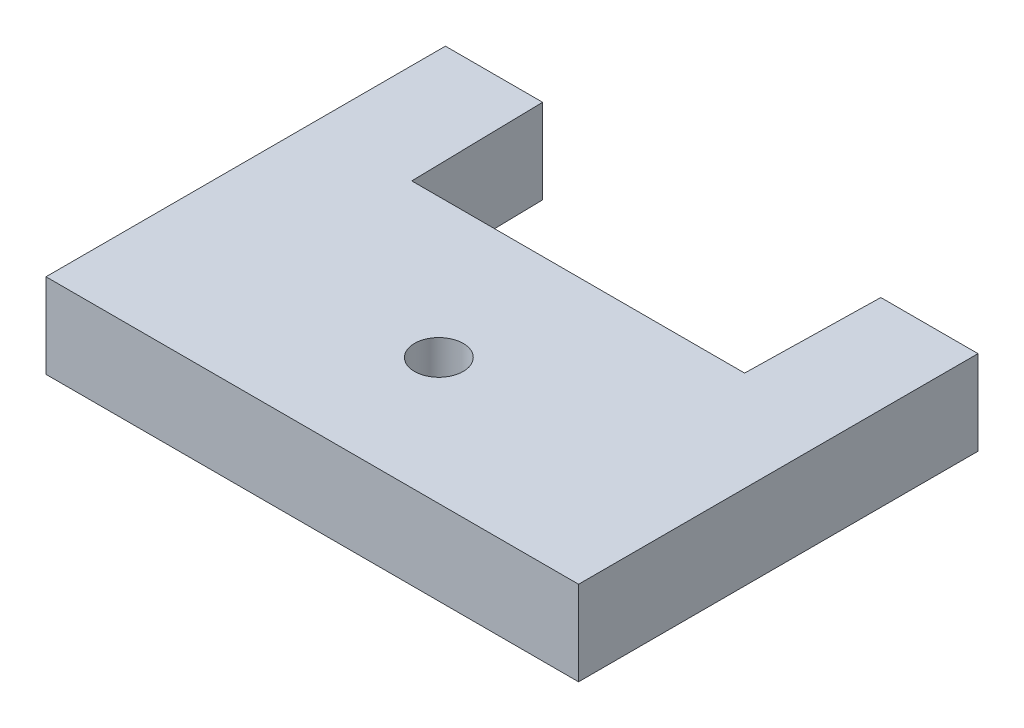
ISO-10303-21;
HEADER;
FILE_DESCRIPTION(('STEP AP214'),'2;1');
FILE_NAME('part.step','',(''),(''),'','','');
FILE_SCHEMA(('AUTOMOTIVE_DESIGN { 1 0 10303 214 1 1 1 1 }'));
ENDSEC;
DATA;
#1=APPLICATION_CONTEXT('core data for automotive mechanical design processes');
#2=APPLICATION_PROTOCOL_DEFINITION('international standard','automotive_design',2000,#1);
#3=PRODUCT_CONTEXT('',#1,'mechanical');
#4=PRODUCT('Part','Part','',(#3));
#5=PRODUCT_RELATED_PRODUCT_CATEGORY('part','',(#4));
#6=PRODUCT_DEFINITION_FORMATION('','',#4);
#7=PRODUCT_DEFINITION_CONTEXT('part definition',#1,'design');
#8=PRODUCT_DEFINITION('design','',#6,#7);
#9=PRODUCT_DEFINITION_SHAPE('','',#8);
#10=(LENGTH_UNIT() NAMED_UNIT(*) SI_UNIT(.MILLI.,.METRE.));
#11=(NAMED_UNIT(*) PLANE_ANGLE_UNIT() SI_UNIT($,.RADIAN.));
#12=(NAMED_UNIT(*) SI_UNIT($,.STERADIAN.) SOLID_ANGLE_UNIT());
#13=UNCERTAINTY_MEASURE_WITH_UNIT(LENGTH_MEASURE(1.E-05),#10,'distance_accuracy_value','');
#14=(GEOMETRIC_REPRESENTATION_CONTEXT(3) GLOBAL_UNCERTAINTY_ASSIGNED_CONTEXT((#13)) GLOBAL_UNIT_ASSIGNED_CONTEXT((#10,
#11,#12)) REPRESENTATION_CONTEXT('',''));
#15=CARTESIAN_POINT('',(0.,0.,0.));
#16=DIRECTION('',(0.,0.,1.));
#17=DIRECTION('',(1.,0.,0.));
#18=AXIS2_PLACEMENT_3D('',#15,#16,#17);
#19=CARTESIAN_POINT('',(-20.,6.35,-15.));
#20=DIRECTION('',(0.,0.,1.));
#21=DIRECTION('',(1.,0.,0.));
#22=AXIS2_PLACEMENT_3D('',#19,#20,#21);
#23=PLANE('',#22);
#24=DIRECTION('',(-1.,0.,0.));
#25=VECTOR('',#24,1.);
#26=CARTESIAN_POINT('',(-20.,0.,-15.));
#27=LINE('',#26,#25);
#28=CARTESIAN_POINT('',(20.,0.,-15.));
#29=VERTEX_POINT('',#28);
#30=CARTESIAN_POINT('',(12.7,0.,-15.));
#31=VERTEX_POINT('',#30);
#32=EDGE_CURVE('E131',#29,#31,#27,.T.);
#33=ORIENTED_EDGE('',*,*,#32,.T.);
#34=DIRECTION('',(0.,1.,0.));
#35=VECTOR('',#34,1.);
#36=CARTESIAN_POINT('',(12.7,0.,-15.));
#37=LINE('',#36,#35);
#38=CARTESIAN_POINT('',(12.7,6.35,-15.));
#39=VERTEX_POINT('',#38);
#40=EDGE_CURVE('E136',#31,#39,#37,.T.);
#41=ORIENTED_EDGE('',*,*,#40,.T.);
#42=DIRECTION('',(-1.,0.,0.));
#43=VECTOR('',#42,1.);
#44=CARTESIAN_POINT('',(-20.,6.35,-15.));
#45=LINE('',#44,#43);
#46=CARTESIAN_POINT('',(20.,6.35,-15.));
#47=VERTEX_POINT('',#46);
#48=EDGE_CURVE('E85',#47,#39,#45,.T.);
#49=ORIENTED_EDGE('',*,*,#48,.F.);
#50=DIRECTION('',(0.,-1.,0.));
#51=VECTOR('',#50,1.);
#52=CARTESIAN_POINT('',(20.,6.35,-15.));
#53=LINE('',#52,#51);
#54=EDGE_CURVE('E11',#47,#29,#53,.T.);
#55=ORIENTED_EDGE('',*,*,#54,.T.);
#56=EDGE_LOOP('',(#33,#41,#49,#55));
#57=FACE_BOUND('',#56,.T.);
#58=ADVANCED_FACE('F33',(#57),#23,.F.);
#59=CARTESIAN_POINT('',(20.,6.35,15.));
#60=DIRECTION('',(-1.,0.,0.));
#61=DIRECTION('',(0.,0.,1.));
#62=AXIS2_PLACEMENT_3D('',#59,#60,#61);
#63=PLANE('',#62);
#64=DIRECTION('',(0.,0.,-1.));
#65=VECTOR('',#64,1.);
#66=CARTESIAN_POINT('',(20.,0.,15.));
#67=LINE('',#66,#65);
#68=CARTESIAN_POINT('',(20.,0.,15.));
#69=VERTEX_POINT('',#68);
#70=EDGE_CURVE('E132',#69,#29,#67,.T.);
#71=ORIENTED_EDGE('',*,*,#70,.T.);
#72=ORIENTED_EDGE('',*,*,#54,.F.);
#73=DIRECTION('',(0.,0.,-1.));
#74=VECTOR('',#73,1.);
#75=CARTESIAN_POINT('',(20.,6.35,15.));
#76=LINE('',#75,#74);
#77=CARTESIAN_POINT('',(20.,6.35,15.));
#78=VERTEX_POINT('',#77);
#79=EDGE_CURVE('E142',#78,#47,#76,.T.);
#80=ORIENTED_EDGE('',*,*,#79,.F.);
#81=DIRECTION('',(0.,-1.,0.));
#82=VECTOR('',#81,1.);
#83=CARTESIAN_POINT('',(20.,6.35,15.));
#84=LINE('',#83,#82);
#85=EDGE_CURVE('E143',#78,#69,#84,.T.);
#86=ORIENTED_EDGE('',*,*,#85,.T.);
#87=EDGE_LOOP('',(#71,#72,#80,#86));
#88=FACE_BOUND('',#87,.T.);
#89=ADVANCED_FACE('F35',(#88),#63,.F.);
#90=CARTESIAN_POINT('',(-12.7,6.35,-15.));
#91=VERTEX_POINT('',#90);
#92=CARTESIAN_POINT('',(-20.,6.35,-15.));
#93=VERTEX_POINT('',#92);
#94=EDGE_CURVE('E124',#91,#93,#45,.T.);
#95=ORIENTED_EDGE('',*,*,#94,.F.);
#96=DIRECTION('',(0.,1.,0.));
#97=VECTOR('',#96,1.);
#98=CARTESIAN_POINT('',(-12.7,0.,-15.));
#99=LINE('',#98,#97);
#100=CARTESIAN_POINT('',(-12.7,0.,-15.));
#101=VERTEX_POINT('',#100);
#102=EDGE_CURVE('E111',#101,#91,#99,.T.);
#103=ORIENTED_EDGE('',*,*,#102,.F.);
#104=CARTESIAN_POINT('',(-20.,0.,-15.));
#105=VERTEX_POINT('',#104);
#106=EDGE_CURVE('E122',#101,#105,#27,.T.);
#107=ORIENTED_EDGE('',*,*,#106,.T.);
#108=DIRECTION('',(0.,-1.,0.));
#109=VECTOR('',#108,1.);
#110=CARTESIAN_POINT('',(-20.,6.35,-15.));
#111=LINE('',#110,#109);
#112=EDGE_CURVE('E41',#93,#105,#111,.T.);
#113=ORIENTED_EDGE('',*,*,#112,.F.);
#114=EDGE_LOOP('',(#95,#103,#107,#113));
#115=FACE_BOUND('',#114,.T.);
#116=ADVANCED_FACE('F120',(#115),#23,.F.);
#117=CARTESIAN_POINT('',(-20.,6.35,15.));
#118=DIRECTION('',(1.,0.,0.));
#119=DIRECTION('',(0.,0.,-1.));
#120=AXIS2_PLACEMENT_3D('',#117,#118,#119);
#121=PLANE('',#120);
#122=DIRECTION('',(0.,0.,1.));
#123=VECTOR('',#122,1.);
#124=CARTESIAN_POINT('',(-20.,0.,15.));
#125=LINE('',#124,#123);
#126=CARTESIAN_POINT('',(-20.,0.,15.));
#127=VERTEX_POINT('',#126);
#128=EDGE_CURVE('E130',#105,#127,#125,.T.);
#129=ORIENTED_EDGE('',*,*,#128,.T.);
#130=DIRECTION('',(0.,-1.,0.));
#131=VECTOR('',#130,1.);
#132=CARTESIAN_POINT('',(-20.,6.35,15.));
#133=LINE('',#132,#131);
#134=CARTESIAN_POINT('',(-20.,6.35,15.));
#135=VERTEX_POINT('',#134);
#136=EDGE_CURVE('E145',#135,#127,#133,.T.);
#137=ORIENTED_EDGE('',*,*,#136,.F.);
#138=DIRECTION('',(0.,0.,1.));
#139=VECTOR('',#138,1.);
#140=CARTESIAN_POINT('',(-20.,6.35,15.));
#141=LINE('',#140,#139);
#142=EDGE_CURVE('E150',#93,#135,#141,.T.);
#143=ORIENTED_EDGE('',*,*,#142,.F.);
#144=ORIENTED_EDGE('',*,*,#112,.T.);
#145=EDGE_LOOP('',(#129,#137,#143,#144));
#146=FACE_BOUND('',#145,.T.);
#147=ADVANCED_FACE('F148',(#146),#121,.F.);
#148=CARTESIAN_POINT('',(-20.,6.35,15.));
#149=DIRECTION('',(0.,0.,-1.));
#150=DIRECTION('',(-1.,0.,0.));
#151=AXIS2_PLACEMENT_3D('',#148,#149,#150);
#152=PLANE('',#151);
#153=DIRECTION('',(1.,0.,0.));
#154=VECTOR('',#153,1.);
#155=CARTESIAN_POINT('',(-20.,0.,15.));
#156=LINE('',#155,#154);
#157=EDGE_CURVE('E78',#127,#69,#156,.T.);
#158=ORIENTED_EDGE('',*,*,#157,.T.);
#159=ORIENTED_EDGE('',*,*,#85,.F.);
#160=DIRECTION('',(1.,0.,0.));
#161=VECTOR('',#160,1.);
#162=CARTESIAN_POINT('',(-20.,6.35,15.));
#163=LINE('',#162,#161);
#164=EDGE_CURVE('E57',#135,#78,#163,.T.);
#165=ORIENTED_EDGE('',*,*,#164,.F.);
#166=ORIENTED_EDGE('',*,*,#136,.T.);
#167=EDGE_LOOP('',(#158,#159,#165,#166));
#168=FACE_BOUND('',#167,.T.);
#169=ADVANCED_FACE('F178',(#168),#152,.F.);
#170=CARTESIAN_POINT('',(0.,6.35,0.));
#171=DIRECTION('',(0.,-1.,0.));
#172=DIRECTION('',(0.,0.,-1.));
#173=AXIS2_PLACEMENT_3D('',#170,#171,#172);
#174=PLANE('',#173);
#175=CARTESIAN_POINT('',(0.,6.35,5.4948));
#176=DIRECTION('',(0.,1.,0.));
#177=DIRECTION('',(0.,0.,1.));
#178=AXIS2_PLACEMENT_3D('',#175,#176,#177);
#179=CIRCLE('',#178,1.8288);
#180=CARTESIAN_POINT('',(0.,6.35,7.3236));
#181=VERTEX_POINT('',#180);
#182=EDGE_CURVE('E170',#181,#181,#179,.T.);
#183=ORIENTED_EDGE('',*,*,#182,.F.);
#184=EDGE_LOOP('',(#183));
#185=FACE_BOUND('',#184,.T.);
#186=ORIENTED_EDGE('',*,*,#48,.T.);
#187=DIRECTION('',(0.0199362164284595,0.,-0.99980125388725));
#188=VECTOR('',#187,1.);
#189=CARTESIAN_POINT('',(12.5,6.35,-4.97));
#190=LINE('',#189,#188);
#191=CARTESIAN_POINT('',(12.5,6.35,-4.97));
#192=VERTEX_POINT('',#191);
#193=EDGE_CURVE('E116',#192,#39,#190,.T.);
#194=ORIENTED_EDGE('',*,*,#193,.F.);
#195=DIRECTION('',(1.,0.,0.));
#196=VECTOR('',#195,1.);
#197=CARTESIAN_POINT('',(-12.5,6.35,-4.97));
#198=LINE('',#197,#196);
#199=CARTESIAN_POINT('',(-12.5,6.35,-4.97));
#200=VERTEX_POINT('',#199);
#201=EDGE_CURVE('E160',#200,#192,#198,.T.);
#202=ORIENTED_EDGE('',*,*,#201,.F.);
#203=DIRECTION('',(0.0199362164284595,0.,0.99980125388725));
#204=VECTOR('',#203,1.);
#205=CARTESIAN_POINT('',(-12.7,6.35,-15.));
#206=LINE('',#205,#204);
#207=EDGE_CURVE('E163',#91,#200,#206,.T.);
#208=ORIENTED_EDGE('',*,*,#207,.F.);
#209=ORIENTED_EDGE('',*,*,#94,.T.);
#210=ORIENTED_EDGE('',*,*,#142,.T.);
#211=ORIENTED_EDGE('',*,*,#164,.T.);
#212=ORIENTED_EDGE('',*,*,#79,.T.);
#213=EDGE_LOOP('',(#186,#194,#202,#208,#209,#210,#211,#212));
#214=FACE_BOUND('',#213,.T.);
#215=ADVANCED_FACE('F176',(#185,#214),#174,.F.);
#216=CARTESIAN_POINT('',(0.,0.,0.));
#217=DIRECTION('',(0.,-1.,0.));
#218=DIRECTION('',(0.,0.,-1.));
#219=AXIS2_PLACEMENT_3D('',#216,#217,#218);
#220=PLANE('',#219);
#221=CARTESIAN_POINT('',(0.,0.,5.4948));
#222=DIRECTION('',(0.,1.,0.));
#223=DIRECTION('',(0.,0.,1.));
#224=AXIS2_PLACEMENT_3D('',#221,#222,#223);
#225=CIRCLE('',#224,1.8288);
#226=CARTESIAN_POINT('',(0.,0.,7.3236));
#227=VERTEX_POINT('',#226);
#228=EDGE_CURVE('E165',#227,#227,#225,.T.);
#229=ORIENTED_EDGE('',*,*,#228,.T.);
#230=EDGE_LOOP('',(#229));
#231=FACE_BOUND('',#230,.T.);
#232=DIRECTION('',(0.0199362164284595,0.,-0.99980125388725));
#233=VECTOR('',#232,1.);
#234=CARTESIAN_POINT('',(12.5,0.,-4.97));
#235=LINE('',#234,#233);
#236=CARTESIAN_POINT('',(12.5,0.,-4.97));
#237=VERTEX_POINT('',#236);
#238=EDGE_CURVE('E125',#237,#31,#235,.T.);
#239=ORIENTED_EDGE('',*,*,#238,.T.);
#240=ORIENTED_EDGE('',*,*,#32,.F.);
#241=ORIENTED_EDGE('',*,*,#70,.F.);
#242=ORIENTED_EDGE('',*,*,#157,.F.);
#243=ORIENTED_EDGE('',*,*,#128,.F.);
#244=ORIENTED_EDGE('',*,*,#106,.F.);
#245=DIRECTION('',(0.0199362164284595,0.,0.99980125388725));
#246=VECTOR('',#245,1.);
#247=CARTESIAN_POINT('',(-12.7,0.,-15.));
#248=LINE('',#247,#246);
#249=CARTESIAN_POINT('',(-12.5,0.,-4.97));
#250=VERTEX_POINT('',#249);
#251=EDGE_CURVE('E107',#101,#250,#248,.T.);
#252=ORIENTED_EDGE('',*,*,#251,.T.);
#253=DIRECTION('',(1.,0.,0.));
#254=VECTOR('',#253,1.);
#255=CARTESIAN_POINT('',(-12.5,0.,-4.97));
#256=LINE('',#255,#254);
#257=EDGE_CURVE('E48',#250,#237,#256,.T.);
#258=ORIENTED_EDGE('',*,*,#257,.T.);
#259=EDGE_LOOP('',(#239,#240,#241,#242,#243,#244,#252,#258));
#260=FACE_BOUND('',#259,.T.);
#261=ADVANCED_FACE('F129',(#231,#260),#220,.T.);
#262=CARTESIAN_POINT('',(12.5,0.,-4.97));
#263=DIRECTION('',(0.99980125388725,0.,0.0199362164284595));
#264=DIRECTION('',(0.0199362164284595,0.,-0.99980125388725));
#265=AXIS2_PLACEMENT_3D('',#262,#263,#264);
#266=PLANE('',#265);
#267=ORIENTED_EDGE('',*,*,#193,.T.);
#268=ORIENTED_EDGE('',*,*,#40,.F.);
#269=ORIENTED_EDGE('',*,*,#238,.F.);
#270=DIRECTION('',(0.,1.,0.));
#271=VECTOR('',#270,1.);
#272=CARTESIAN_POINT('',(12.5,0.,-4.97));
#273=LINE('',#272,#271);
#274=EDGE_CURVE('E156',#237,#192,#273,.T.);
#275=ORIENTED_EDGE('',*,*,#274,.T.);
#276=EDGE_LOOP('',(#267,#268,#269,#275));
#277=FACE_BOUND('',#276,.T.);
#278=ADVANCED_FACE('F188',(#277),#266,.F.);
#279=CARTESIAN_POINT('',(-12.5,0.,-4.97));
#280=DIRECTION('',(0.,0.,1.));
#281=DIRECTION('',(1.,0.,0.));
#282=AXIS2_PLACEMENT_3D('',#279,#280,#281);
#283=PLANE('',#282);
#284=ORIENTED_EDGE('',*,*,#201,.T.);
#285=ORIENTED_EDGE('',*,*,#274,.F.);
#286=ORIENTED_EDGE('',*,*,#257,.F.);
#287=DIRECTION('',(0.,1.,0.));
#288=VECTOR('',#287,1.);
#289=CARTESIAN_POINT('',(-12.5,0.,-4.97));
#290=LINE('',#289,#288);
#291=EDGE_CURVE('E113',#250,#200,#290,.T.);
#292=ORIENTED_EDGE('',*,*,#291,.T.);
#293=EDGE_LOOP('',(#284,#285,#286,#292));
#294=FACE_BOUND('',#293,.T.);
#295=ADVANCED_FACE('F189',(#294),#283,.F.);
#296=CARTESIAN_POINT('',(-12.7,0.,-15.));
#297=DIRECTION('',(-0.99980125388725,0.,0.0199362164284595));
#298=DIRECTION('',(0.0199362164284595,0.,0.99980125388725));
#299=AXIS2_PLACEMENT_3D('',#296,#297,#298);
#300=PLANE('',#299);
#301=ORIENTED_EDGE('',*,*,#207,.T.);
#302=ORIENTED_EDGE('',*,*,#291,.F.);
#303=ORIENTED_EDGE('',*,*,#251,.F.);
#304=ORIENTED_EDGE('',*,*,#102,.T.);
#305=EDGE_LOOP('',(#301,#302,#303,#304));
#306=FACE_BOUND('',#305,.T.);
#307=ADVANCED_FACE('F110',(#306),#300,.F.);
#308=CARTESIAN_POINT('',(0.,6.35,5.4948));
#309=DIRECTION('',(0.,1.,0.));
#310=DIRECTION('',(0.,0.,1.));
#311=AXIS2_PLACEMENT_3D('',#308,#309,#310);
#312=CYLINDRICAL_SURFACE('',#311,1.8288);
#313=ORIENTED_EDGE('',*,*,#228,.F.);
#314=EDGE_LOOP('',(#313));
#315=FACE_BOUND('',#314,.T.);
#316=ORIENTED_EDGE('',*,*,#182,.T.);
#317=EDGE_LOOP('',(#316));
#318=FACE_BOUND('',#317,.T.);
#319=ADVANCED_FACE('F174',(#315,#318),#312,.F.);
#320=CLOSED_SHELL('',(#58,#89,#116,#147,#169,#215,#261,#278,#295,#307,#319));
#321=MANIFOLD_SOLID_BREP('B2',#320);
#322=ADVANCED_BREP_SHAPE_REPRESENTATION('',(#18,#321),#14);
#323=SHAPE_DEFINITION_REPRESENTATION(#9,#322);
ENDSEC;
END-ISO-10303-21;
